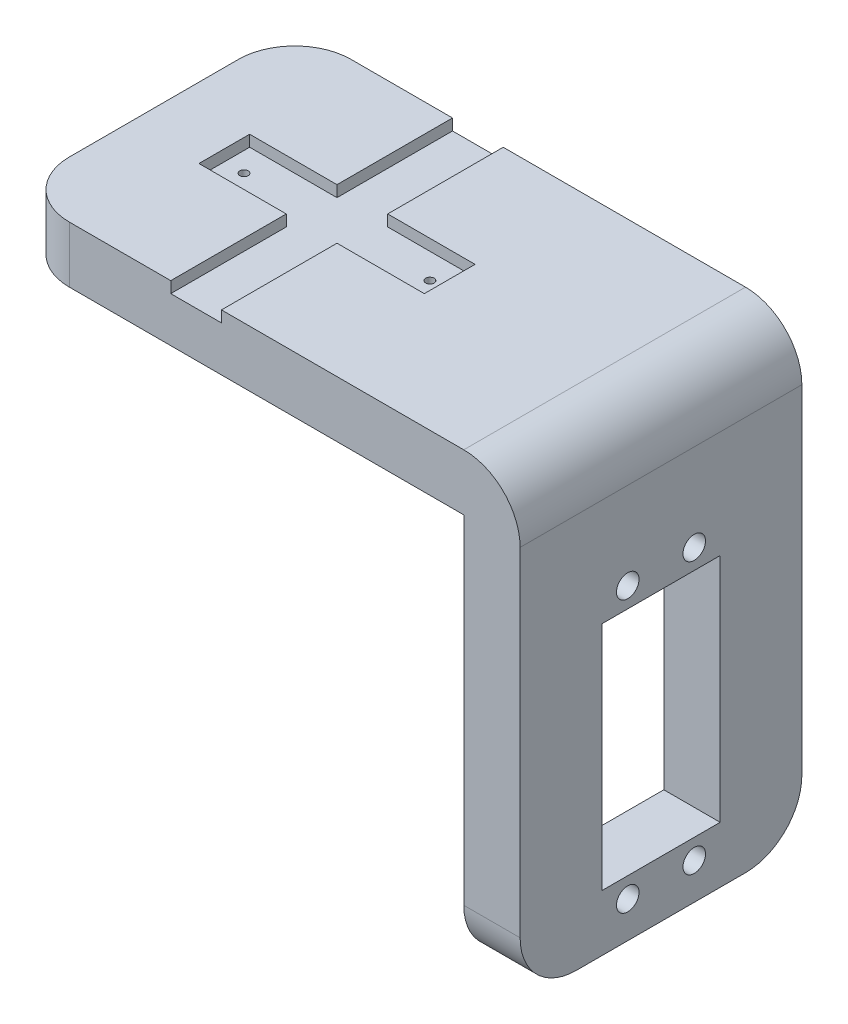
ISO-10303-21;
HEADER;
FILE_DESCRIPTION(('STEP AP214'),'2;1');
FILE_NAME('part.step','',(''),(''),'','','');
FILE_SCHEMA(('AUTOMOTIVE_DESIGN { 1 0 10303 214 1 1 1 1 }'));
ENDSEC;
DATA;
#1=APPLICATION_CONTEXT('core data for automotive mechanical design processes');
#2=APPLICATION_PROTOCOL_DEFINITION('international standard','automotive_design',2000,#1);
#3=PRODUCT_CONTEXT('',#1,'mechanical');
#4=PRODUCT('Part','Part','',(#3));
#5=PRODUCT_RELATED_PRODUCT_CATEGORY('part','',(#4));
#6=PRODUCT_DEFINITION_FORMATION('','',#4);
#7=PRODUCT_DEFINITION_CONTEXT('part definition',#1,'design');
#8=PRODUCT_DEFINITION('design','',#6,#7);
#9=PRODUCT_DEFINITION_SHAPE('','',#8);
#10=(LENGTH_UNIT() NAMED_UNIT(*) SI_UNIT(.MILLI.,.METRE.));
#11=(NAMED_UNIT(*) PLANE_ANGLE_UNIT() SI_UNIT($,.RADIAN.));
#12=(NAMED_UNIT(*) SI_UNIT($,.STERADIAN.) SOLID_ANGLE_UNIT());
#13=UNCERTAINTY_MEASURE_WITH_UNIT(LENGTH_MEASURE(1.E-05),#10,'distance_accuracy_value','');
#14=(GEOMETRIC_REPRESENTATION_CONTEXT(3) GLOBAL_UNCERTAINTY_ASSIGNED_CONTEXT((#13)) GLOBAL_UNIT_ASSIGNED_CONTEXT((#10,
#11,#12)) REPRESENTATION_CONTEXT('',''));
#15=CARTESIAN_POINT('',(0.,0.,0.));
#16=DIRECTION('',(0.,0.,1.));
#17=DIRECTION('',(1.,0.,0.));
#18=AXIS2_PLACEMENT_3D('',#15,#16,#17);
#19=CARTESIAN_POINT('',(38.5515908381555,-70.,-6.57807000019985));
#20=DIRECTION('',(-1.,0.,0.));
#21=DIRECTION('',(0.,0.,1.));
#22=AXIS2_PLACEMENT_3D('',#19,#20,#21);
#23=PLANE('',#22);
#24=CARTESIAN_POINT('',(38.5515908381555,-15.44,24.3219299998002));
#25=DIRECTION('',(-1.,0.,0.));
#26=DIRECTION('',(0.,0.,-1.));
#27=AXIS2_PLACEMENT_3D('',#24,#25,#26);
#28=CIRCLE('',#27,2.);
#29=CARTESIAN_POINT('',(38.5515908381555,-15.44,22.3219299998002));
#30=VERTEX_POINT('',#29);
#31=EDGE_CURVE('E450',#30,#30,#28,.T.);
#32=ORIENTED_EDGE('',*,*,#31,.F.);
#33=EDGE_LOOP('',(#32));
#34=FACE_BOUND('',#33,.T.);
#35=CARTESIAN_POINT('',(38.5515908381555,-15.44,12.5219299998001));
#36=DIRECTION('',(1.,0.,0.));
#37=DIRECTION('',(0.,0.,1.));
#38=AXIS2_PLACEMENT_3D('',#35,#36,#37);
#39=CIRCLE('',#38,2.);
#40=CARTESIAN_POINT('',(38.5515908381555,-15.44,14.5219299998001));
#41=VERTEX_POINT('',#40);
#42=EDGE_CURVE('E441',#41,#41,#39,.T.);
#43=ORIENTED_EDGE('',*,*,#42,.T.);
#44=EDGE_LOOP('',(#43));
#45=FACE_BOUND('',#44,.T.);
#46=CARTESIAN_POINT('',(38.5515908381555,-63.56,24.3219299998002));
#47=DIRECTION('',(1.,0.,0.));
#48=DIRECTION('',(0.,0.,-1.));
#49=AXIS2_PLACEMENT_3D('',#46,#47,#48);
#50=CIRCLE('',#49,2.);
#51=CARTESIAN_POINT('',(38.5515908381555,-63.56,22.3219299998002));
#52=VERTEX_POINT('',#51);
#53=EDGE_CURVE('E438',#52,#52,#50,.T.);
#54=ORIENTED_EDGE('',*,*,#53,.T.);
#55=EDGE_LOOP('',(#54));
#56=FACE_BOUND('',#55,.T.);
#57=CARTESIAN_POINT('',(38.5515908381555,-63.56,12.5219299998002));
#58=DIRECTION('',(-1.,0.,0.));
#59=DIRECTION('',(0.,0.,1.));
#60=AXIS2_PLACEMENT_3D('',#57,#58,#59);
#61=CIRCLE('',#60,2.);
#62=CARTESIAN_POINT('',(38.5515908381555,-63.56,14.5219299998002));
#63=VERTEX_POINT('',#62);
#64=EDGE_CURVE('E239',#63,#63,#61,.T.);
#65=ORIENTED_EDGE('',*,*,#64,.F.);
#66=EDGE_LOOP('',(#65));
#67=FACE_BOUND('',#66,.T.);
#68=DIRECTION('',(0.,1.,0.));
#69=VECTOR('',#68,1.);
#70=CARTESIAN_POINT('',(38.5515908381555,-70.,-6.57807000019985));
#71=LINE('',#70,#69);
#72=CARTESIAN_POINT('',(38.5515908381555,-60.,-6.57807000019985));
#73=VERTEX_POINT('',#72);
#74=CARTESIAN_POINT('',(38.5515908381555,0.,-6.57807000019985));
#75=VERTEX_POINT('',#74);
#76=EDGE_CURVE('E255',#73,#75,#71,.T.);
#77=ORIENTED_EDGE('',*,*,#76,.F.);
#78=CARTESIAN_POINT('',(38.5515908381555,-60.,3.42192999980015));
#79=DIRECTION('',(-1.,0.,0.));
#80=DIRECTION('',(0.,0.,1.));
#81=AXIS2_PLACEMENT_3D('',#78,#79,#80);
#82=CIRCLE('',#81,10.);
#83=CARTESIAN_POINT('',(38.5515908381555,-70.,3.42192999980015));
#84=VERTEX_POINT('',#83);
#85=EDGE_CURVE('E58',#73,#84,#82,.T.);
#86=ORIENTED_EDGE('',*,*,#85,.T.);
#87=DIRECTION('',(0.,0.,1.));
#88=VECTOR('',#87,1.);
#89=CARTESIAN_POINT('',(38.5515908381555,-70.,-6.57807000019985));
#90=LINE('',#89,#88);
#91=CARTESIAN_POINT('',(38.5515908381555,-70.,33.4219299998002));
#92=VERTEX_POINT('',#91);
#93=EDGE_CURVE('E248',#84,#92,#90,.T.);
#94=ORIENTED_EDGE('',*,*,#93,.T.);
#95=CARTESIAN_POINT('',(38.5515908381555,-60.,33.4219299998001));
#96=DIRECTION('',(-1.,0.,0.));
#97=DIRECTION('',(0.,0.,1.));
#98=AXIS2_PLACEMENT_3D('',#95,#96,#97);
#99=CIRCLE('',#98,10.);
#100=CARTESIAN_POINT('',(38.5515908381555,-60.,43.4219299998001));
#101=VERTEX_POINT('',#100);
#102=EDGE_CURVE('E420',#92,#101,#99,.T.);
#103=ORIENTED_EDGE('',*,*,#102,.T.);
#104=DIRECTION('',(0.,1.,0.));
#105=VECTOR('',#104,1.);
#106=CARTESIAN_POINT('',(38.5515908381555,-70.,43.4219299998001));
#107=LINE('',#106,#105);
#108=CARTESIAN_POINT('',(38.5515908381555,0.,43.4219299998001));
#109=VERTEX_POINT('',#108);
#110=EDGE_CURVE('E254',#101,#109,#107,.T.);
#111=ORIENTED_EDGE('',*,*,#110,.T.);
#112=DIRECTION('',(0.,0.,-1.));
#113=VECTOR('',#112,1.);
#114=CARTESIAN_POINT('',(38.5515908381555,0.,-6.57807000019985));
#115=LINE('',#114,#113);
#116=EDGE_CURVE('E375',#109,#75,#115,.T.);
#117=ORIENTED_EDGE('',*,*,#116,.T.);
#118=EDGE_LOOP('',(#77,#86,#94,#103,#111,#117));
#119=FACE_BOUND('',#118,.T.);
#120=DIRECTION('',(0.,0.,-1.));
#121=VECTOR('',#120,1.);
#122=CARTESIAN_POINT('',(38.5515908381555,-19.,18.4219299998002));
#123=LINE('',#122,#121);
#124=CARTESIAN_POINT('',(38.5515908381555,-19.,28.9219299998002));
#125=VERTEX_POINT('',#124);
#126=CARTESIAN_POINT('',(38.5515908381555,-19.,7.92192999980015));
#127=VERTEX_POINT('',#126);
#128=EDGE_CURVE('E234',#125,#127,#123,.T.);
#129=ORIENTED_EDGE('',*,*,#128,.F.);
#130=DIRECTION('',(0.,-1.,0.));
#131=VECTOR('',#130,1.);
#132=CARTESIAN_POINT('',(38.5515908381555,-60.,28.9219299998001));
#133=LINE('',#132,#131);
#134=CARTESIAN_POINT('',(38.5515908381555,-60.,28.9219299998001));
#135=VERTEX_POINT('',#134);
#136=EDGE_CURVE('E231',#125,#135,#133,.T.);
#137=ORIENTED_EDGE('',*,*,#136,.T.);
#138=DIRECTION('',(0.,0.,1.));
#139=VECTOR('',#138,1.);
#140=CARTESIAN_POINT('',(38.5515908381555,-60.,18.4219299998001));
#141=LINE('',#140,#139);
#142=CARTESIAN_POINT('',(38.5515908381555,-60.,7.92192999980015));
#143=VERTEX_POINT('',#142);
#144=EDGE_CURVE('E214',#143,#135,#141,.T.);
#145=ORIENTED_EDGE('',*,*,#144,.F.);
#146=DIRECTION('',(0.,-1.,0.));
#147=VECTOR('',#146,1.);
#148=CARTESIAN_POINT('',(38.5515908381555,-60.,7.92192999980015));
#149=LINE('',#148,#147);
#150=EDGE_CURVE('E224',#127,#143,#149,.T.);
#151=ORIENTED_EDGE('',*,*,#150,.F.);
#152=EDGE_LOOP('',(#129,#137,#145,#151));
#153=FACE_BOUND('',#152,.T.);
#154=ADVANCED_FACE('F33',(#34,#45,#56,#67,#119,#153),#23,.T.);
#155=CARTESIAN_POINT('',(48.5515908381555,-70.,-6.57807000019985));
#156=DIRECTION('',(1.,0.,0.));
#157=DIRECTION('',(0.,0.,-1.));
#158=AXIS2_PLACEMENT_3D('',#155,#156,#157);
#159=PLANE('',#158);
#160=CARTESIAN_POINT('',(48.5515908381555,-15.44,24.3219299998002));
#161=DIRECTION('',(1.,0.,0.));
#162=DIRECTION('',(0.,0.,-1.));
#163=AXIS2_PLACEMENT_3D('',#160,#161,#162);
#164=CIRCLE('',#163,2.);
#165=CARTESIAN_POINT('',(48.5515908381555,-15.44,22.3219299998002));
#166=VERTEX_POINT('',#165);
#167=EDGE_CURVE('E37',#166,#166,#164,.T.);
#168=ORIENTED_EDGE('',*,*,#167,.F.);
#169=EDGE_LOOP('',(#168));
#170=FACE_BOUND('',#169,.T.);
#171=CARTESIAN_POINT('',(48.5515908381555,-15.44,12.5219299998001));
#172=DIRECTION('',(1.,0.,0.));
#173=DIRECTION('',(0.,0.,-1.));
#174=AXIS2_PLACEMENT_3D('',#171,#172,#173);
#175=CIRCLE('',#174,2.);
#176=CARTESIAN_POINT('',(48.5515908381555,-15.44,10.5219299998001));
#177=VERTEX_POINT('',#176);
#178=EDGE_CURVE('E439',#177,#177,#175,.F.);
#179=ORIENTED_EDGE('',*,*,#178,.T.);
#180=EDGE_LOOP('',(#179));
#181=FACE_BOUND('',#180,.T.);
#182=CARTESIAN_POINT('',(48.5515908381555,-63.56,24.3219299998002));
#183=DIRECTION('',(1.,0.,0.));
#184=DIRECTION('',(0.,0.,-1.));
#185=AXIS2_PLACEMENT_3D('',#182,#183,#184);
#186=CIRCLE('',#185,2.);
#187=CARTESIAN_POINT('',(48.5515908381555,-63.56,22.3219299998002));
#188=VERTEX_POINT('',#187);
#189=EDGE_CURVE('E436',#188,#188,#186,.F.);
#190=ORIENTED_EDGE('',*,*,#189,.T.);
#191=EDGE_LOOP('',(#190));
#192=FACE_BOUND('',#191,.T.);
#193=CARTESIAN_POINT('',(48.5515908381555,-63.56,12.5219299998001));
#194=DIRECTION('',(1.,0.,0.));
#195=DIRECTION('',(0.,0.,-1.));
#196=AXIS2_PLACEMENT_3D('',#193,#194,#195);
#197=CIRCLE('',#196,2.);
#198=CARTESIAN_POINT('',(48.5515908381555,-63.56,10.5219299998001));
#199=VERTEX_POINT('',#198);
#200=EDGE_CURVE('E236',#199,#199,#197,.T.);
#201=ORIENTED_EDGE('',*,*,#200,.F.);
#202=EDGE_LOOP('',(#201));
#203=FACE_BOUND('',#202,.T.);
#204=DIRECTION('',(0.,0.,-1.));
#205=VECTOR('',#204,1.);
#206=CARTESIAN_POINT('',(48.5515908381555,-70.,-6.57807000019985));
#207=LINE('',#206,#205);
#208=CARTESIAN_POINT('',(48.5515908381555,-70.,33.4219299998002));
#209=VERTEX_POINT('',#208);
#210=CARTESIAN_POINT('',(48.5515908381555,-70.,3.42192999980015));
#211=VERTEX_POINT('',#210);
#212=EDGE_CURVE('E251',#209,#211,#207,.T.);
#213=ORIENTED_EDGE('',*,*,#212,.T.);
#214=CARTESIAN_POINT('',(48.5515908381555,-60.,3.42192999980015));
#215=DIRECTION('',(1.,0.,0.));
#216=DIRECTION('',(0.,0.,-1.));
#217=AXIS2_PLACEMENT_3D('',#214,#215,#216);
#218=CIRCLE('',#217,10.);
#219=CARTESIAN_POINT('',(48.5515908381555,-60.,-6.57807000019985));
#220=VERTEX_POINT('',#219);
#221=EDGE_CURVE('E428',#211,#220,#218,.T.);
#222=ORIENTED_EDGE('',*,*,#221,.T.);
#223=DIRECTION('',(0.,1.,0.));
#224=VECTOR('',#223,1.);
#225=CARTESIAN_POINT('',(48.5515908381555,-70.,-6.57807000019985));
#226=LINE('',#225,#224);
#227=CARTESIAN_POINT('',(48.5515908381555,0.,-6.57807000019985));
#228=VERTEX_POINT('',#227);
#229=EDGE_CURVE('E258',#220,#228,#226,.T.);
#230=ORIENTED_EDGE('',*,*,#229,.T.);
#231=DIRECTION('',(0.,0.,1.));
#232=VECTOR('',#231,1.);
#233=CARTESIAN_POINT('',(48.5515908381555,0.,-6.57807000019985));
#234=LINE('',#233,#232);
#235=CARTESIAN_POINT('',(48.5515908381555,0.,43.4219299998001));
#236=VERTEX_POINT('',#235);
#237=EDGE_CURVE('E372',#228,#236,#234,.T.);
#238=ORIENTED_EDGE('',*,*,#237,.T.);
#239=DIRECTION('',(0.,1.,0.));
#240=VECTOR('',#239,1.);
#241=CARTESIAN_POINT('',(48.5515908381555,-70.,43.4219299998001));
#242=LINE('',#241,#240);
#243=CARTESIAN_POINT('',(48.5515908381555,-60.,43.4219299998001));
#244=VERTEX_POINT('',#243);
#245=EDGE_CURVE('E260',#244,#236,#242,.T.);
#246=ORIENTED_EDGE('',*,*,#245,.F.);
#247=CARTESIAN_POINT('',(48.5515908381555,-60.,33.4219299998001));
#248=DIRECTION('',(1.,0.,0.));
#249=DIRECTION('',(0.,0.,-1.));
#250=AXIS2_PLACEMENT_3D('',#247,#248,#249);
#251=CIRCLE('',#250,10.);
#252=EDGE_CURVE('E418',#244,#209,#251,.T.);
#253=ORIENTED_EDGE('',*,*,#252,.T.);
#254=EDGE_LOOP('',(#213,#222,#230,#238,#246,#253));
#255=FACE_BOUND('',#254,.T.);
#256=DIRECTION('',(0.,1.,0.));
#257=VECTOR('',#256,1.);
#258=CARTESIAN_POINT('',(48.5515908381555,-70.,28.9219299998001));
#259=LINE('',#258,#257);
#260=CARTESIAN_POINT('',(48.5515908381555,-60.,28.9219299998001));
#261=VERTEX_POINT('',#260);
#262=CARTESIAN_POINT('',(48.5515908381555,-19.,28.9219299998001));
#263=VERTEX_POINT('',#262);
#264=EDGE_CURVE('E11',#261,#263,#259,.T.);
#265=ORIENTED_EDGE('',*,*,#264,.T.);
#266=DIRECTION('',(0.,0.,1.));
#267=VECTOR('',#266,1.);
#268=CARTESIAN_POINT('',(48.5515908381555,-19.,-6.57807000019987));
#269=LINE('',#268,#267);
#270=CARTESIAN_POINT('',(48.5515908381555,-19.,7.92192999980015));
#271=VERTEX_POINT('',#270);
#272=EDGE_CURVE('E431',#271,#263,#269,.T.);
#273=ORIENTED_EDGE('',*,*,#272,.F.);
#274=DIRECTION('',(0.,1.,0.));
#275=VECTOR('',#274,1.);
#276=CARTESIAN_POINT('',(48.5515908381555,-70.,7.92192999980015));
#277=LINE('',#276,#275);
#278=CARTESIAN_POINT('',(48.5515908381555,-60.,7.92192999980015));
#279=VERTEX_POINT('',#278);
#280=EDGE_CURVE('E433',#279,#271,#277,.T.);
#281=ORIENTED_EDGE('',*,*,#280,.F.);
#282=DIRECTION('',(0.,0.,-1.));
#283=VECTOR('',#282,1.);
#284=CARTESIAN_POINT('',(48.5515908381555,-60.,-6.57807000019985));
#285=LINE('',#284,#283);
#286=EDGE_CURVE('E42',#261,#279,#285,.T.);
#287=ORIENTED_EDGE('',*,*,#286,.F.);
#288=EDGE_LOOP('',(#265,#273,#281,#287));
#289=FACE_BOUND('',#288,.T.);
#290=ADVANCED_FACE('F458',(#170,#181,#192,#203,#255,#289),#159,.T.);
#291=CARTESIAN_POINT('',(-21.4484091618445,-60.,3.42192999980015));
#292=DIRECTION('',(-1.,0.,0.));
#293=DIRECTION('',(0.,0.,1.));
#294=AXIS2_PLACEMENT_3D('',#291,#292,#293);
#295=CYLINDRICAL_SURFACE('',#294,10.);
#296=DIRECTION('',(-1.,0.,0.));
#297=VECTOR('',#296,1.);
#298=CARTESIAN_POINT('',(-21.4484091618445,-60.,-6.57807000019985));
#299=LINE('',#298,#297);
#300=EDGE_CURVE('E422',#220,#73,#299,.T.);
#301=ORIENTED_EDGE('',*,*,#300,.F.);
#302=ORIENTED_EDGE('',*,*,#221,.F.);
#303=DIRECTION('',(-1.,0.,0.));
#304=VECTOR('',#303,1.);
#305=CARTESIAN_POINT('',(0.,-70.,3.42192999980015));
#306=LINE('',#305,#304);
#307=EDGE_CURVE('E425',#84,#211,#306,.F.);
#308=ORIENTED_EDGE('',*,*,#307,.F.);
#309=ORIENTED_EDGE('',*,*,#85,.F.);
#310=EDGE_LOOP('',(#301,#302,#308,#309));
#311=FACE_BOUND('',#310,.T.);
#312=ADVANCED_FACE('F35',(#311),#295,.T.);
#313=CARTESIAN_POINT('',(0.,-60.,33.4219299998001));
#314=DIRECTION('',(-1.,0.,0.));
#315=DIRECTION('',(0.,0.,1.));
#316=AXIS2_PLACEMENT_3D('',#313,#314,#315);
#317=CYLINDRICAL_SURFACE('',#316,10.);
#318=DIRECTION('',(-1.,0.,0.));
#319=VECTOR('',#318,1.);
#320=CARTESIAN_POINT('',(0.,-70.,33.4219299998001));
#321=LINE('',#320,#319);
#322=EDGE_CURVE('E412',#209,#92,#321,.T.);
#323=ORIENTED_EDGE('',*,*,#322,.F.);
#324=ORIENTED_EDGE('',*,*,#252,.F.);
#325=DIRECTION('',(-1.,0.,0.));
#326=VECTOR('',#325,1.);
#327=CARTESIAN_POINT('',(-21.4484091618445,-60.,43.4219299998001));
#328=LINE('',#327,#326);
#329=EDGE_CURVE('E415',#101,#244,#328,.F.);
#330=ORIENTED_EDGE('',*,*,#329,.F.);
#331=ORIENTED_EDGE('',*,*,#102,.F.);
#332=EDGE_LOOP('',(#323,#324,#330,#331));
#333=FACE_BOUND('',#332,.T.);
#334=ADVANCED_FACE('F544',(#333),#317,.T.);
#335=CARTESIAN_POINT('',(-31.4484091618445,10.,33.4219299998001));
#336=DIRECTION('',(0.,-1.,0.));
#337=DIRECTION('',(0.,0.,-1.));
#338=AXIS2_PLACEMENT_3D('',#335,#336,#337);
#339=CYLINDRICAL_SURFACE('',#338,10.);
#340=DIRECTION('',(0.,-1.,0.));
#341=VECTOR('',#340,1.);
#342=CARTESIAN_POINT('',(-31.4484091618445,10.,43.4219299998001));
#343=LINE('',#342,#341);
#344=CARTESIAN_POINT('',(-31.4484091618445,10.,43.4219299998001));
#345=VERTEX_POINT('',#344);
#346=CARTESIAN_POINT('',(-31.4484091618445,0.,43.4219299998001));
#347=VERTEX_POINT('',#346);
#348=EDGE_CURVE('E402',#345,#347,#343,.T.);
#349=ORIENTED_EDGE('',*,*,#348,.F.);
#350=CARTESIAN_POINT('',(-31.4484091618445,10.,33.4219299998001));
#351=DIRECTION('',(0.,1.,0.));
#352=DIRECTION('',(0.,0.,1.));
#353=AXIS2_PLACEMENT_3D('',#350,#351,#352);
#354=CIRCLE('',#353,10.);
#355=CARTESIAN_POINT('',(-41.4484091618445,10.,33.4219299998002));
#356=VERTEX_POINT('',#355);
#357=EDGE_CURVE('E408',#356,#345,#354,.T.);
#358=ORIENTED_EDGE('',*,*,#357,.F.);
#359=DIRECTION('',(0.,-1.,0.));
#360=VECTOR('',#359,1.);
#361=CARTESIAN_POINT('',(-41.4484091618445,0.,33.4219299998001));
#362=LINE('',#361,#360);
#363=CARTESIAN_POINT('',(-41.4484091618445,0.,33.4219299998002));
#364=VERTEX_POINT('',#363);
#365=EDGE_CURVE('E405',#364,#356,#362,.F.);
#366=ORIENTED_EDGE('',*,*,#365,.F.);
#367=CARTESIAN_POINT('',(-31.4484091618445,0.,33.4219299998001));
#368=DIRECTION('',(0.,1.,0.));
#369=DIRECTION('',(0.,0.,1.));
#370=AXIS2_PLACEMENT_3D('',#367,#368,#369);
#371=CIRCLE('',#370,10.);
#372=EDGE_CURVE('E410',#347,#364,#371,.F.);
#373=ORIENTED_EDGE('',*,*,#372,.F.);
#374=EDGE_LOOP('',(#349,#358,#366,#373));
#375=FACE_BOUND('',#374,.T.);
#376=ADVANCED_FACE('F549',(#375),#339,.T.);
#377=CARTESIAN_POINT('',(-31.4484091618445,10.,3.42192999980015));
#378=DIRECTION('',(0.,1.,0.));
#379=DIRECTION('',(0.,0.,1.));
#380=AXIS2_PLACEMENT_3D('',#377,#378,#379);
#381=CYLINDRICAL_SURFACE('',#380,10.);
#382=DIRECTION('',(0.,1.,0.));
#383=VECTOR('',#382,1.);
#384=CARTESIAN_POINT('',(-31.4484091618445,10.,-6.57807000019985));
#385=LINE('',#384,#383);
#386=CARTESIAN_POINT('',(-31.4484091618445,0.,-6.57807000019985));
#387=VERTEX_POINT('',#386);
#388=CARTESIAN_POINT('',(-31.4484091618445,10.,-6.57807000019985));
#389=VERTEX_POINT('',#388);
#390=EDGE_CURVE('E391',#387,#389,#385,.T.);
#391=ORIENTED_EDGE('',*,*,#390,.F.);
#392=CARTESIAN_POINT('',(-31.4484091618445,0.,3.42192999980015));
#393=DIRECTION('',(0.,1.,0.));
#394=DIRECTION('',(0.,0.,1.));
#395=AXIS2_PLACEMENT_3D('',#392,#393,#394);
#396=CIRCLE('',#395,10.);
#397=CARTESIAN_POINT('',(-41.4484091618445,0.,3.42192999980015));
#398=VERTEX_POINT('',#397);
#399=EDGE_CURVE('E397',#398,#387,#396,.F.);
#400=ORIENTED_EDGE('',*,*,#399,.F.);
#401=DIRECTION('',(0.,1.,0.));
#402=VECTOR('',#401,1.);
#403=CARTESIAN_POINT('',(-41.4484091618445,0.,3.42192999980015));
#404=LINE('',#403,#402);
#405=CARTESIAN_POINT('',(-41.4484091618445,10.,3.42192999980015));
#406=VERTEX_POINT('',#405);
#407=EDGE_CURVE('E394',#406,#398,#404,.F.);
#408=ORIENTED_EDGE('',*,*,#407,.F.);
#409=CARTESIAN_POINT('',(-31.4484091618445,10.,3.42192999980015));
#410=DIRECTION('',(0.,1.,0.));
#411=DIRECTION('',(0.,0.,1.));
#412=AXIS2_PLACEMENT_3D('',#409,#410,#411);
#413=CIRCLE('',#412,10.);
#414=EDGE_CURVE('E399',#389,#406,#413,.T.);
#415=ORIENTED_EDGE('',*,*,#414,.F.);
#416=EDGE_LOOP('',(#391,#400,#408,#415));
#417=FACE_BOUND('',#416,.T.);
#418=ADVANCED_FACE('F478',(#417),#381,.T.);
#419=CARTESIAN_POINT('',(38.5515908381555,0.,-6.57807000019985));
#420=DIRECTION('',(0.,0.,1.));
#421=DIRECTION('',(1.,0.,0.));
#422=AXIS2_PLACEMENT_3D('',#419,#420,#421);
#423=CYLINDRICAL_SURFACE('',#422,10.);
#424=ORIENTED_EDGE('',*,*,#237,.F.);
#425=CARTESIAN_POINT('',(38.5515908381555,0.,-6.57807000019985));
#426=DIRECTION('',(0.,0.,1.));
#427=DIRECTION('',(1.,0.,0.));
#428=AXIS2_PLACEMENT_3D('',#425,#426,#427);
#429=CIRCLE('',#428,10.);
#430=CARTESIAN_POINT('',(38.5515908381555,10.,-6.57807000019985));
#431=VERTEX_POINT('',#430);
#432=EDGE_CURVE('E386',#431,#228,#429,.F.);
#433=ORIENTED_EDGE('',*,*,#432,.F.);
#434=DIRECTION('',(0.,0.,1.));
#435=VECTOR('',#434,1.);
#436=CARTESIAN_POINT('',(38.5515908381555,10.,0.));
#437=LINE('',#436,#435);
#438=CARTESIAN_POINT('',(38.5515908381555,10.,43.4219299998001));
#439=VERTEX_POINT('',#438);
#440=EDGE_CURVE('E383',#439,#431,#437,.F.);
#441=ORIENTED_EDGE('',*,*,#440,.F.);
#442=CARTESIAN_POINT('',(38.5515908381555,0.,43.4219299998002));
#443=DIRECTION('',(0.,0.,-1.));
#444=DIRECTION('',(-1.,0.,0.));
#445=AXIS2_PLACEMENT_3D('',#442,#443,#444);
#446=CIRCLE('',#445,10.);
#447=EDGE_CURVE('E389',#236,#439,#446,.F.);
#448=ORIENTED_EDGE('',*,*,#447,.F.);
#449=EDGE_LOOP('',(#424,#433,#441,#448));
#450=FACE_BOUND('',#449,.T.);
#451=ADVANCED_FACE('F531',(#450),#423,.T.);
#452=CARTESIAN_POINT('',(0.,10.,0.));
#453=DIRECTION('',(0.,1.,0.));
#454=DIRECTION('',(0.,0.,1.));
#455=AXIS2_PLACEMENT_3D('',#452,#453,#454);
#456=PLANE('',#455);
#457=DIRECTION('',(1.,0.,0.));
#458=VECTOR('',#457,1.);
#459=CARTESIAN_POINT('',(-21.4484091618445,10.,43.4219299998001));
#460=LINE('',#459,#458);
#461=CARTESIAN_POINT('',(-4.44840916184454,10.,43.4219299998002));
#462=VERTEX_POINT('',#461);
#463=EDGE_CURVE('E369',#462,#439,#460,.T.);
#464=ORIENTED_EDGE('',*,*,#463,.T.);
#465=ORIENTED_EDGE('',*,*,#440,.T.);
#466=DIRECTION('',(-1.,0.,0.));
#467=VECTOR('',#466,1.);
#468=CARTESIAN_POINT('',(-21.4484091618445,10.,-6.57807000019985));
#469=LINE('',#468,#467);
#470=CARTESIAN_POINT('',(-4.44840916184454,10.,-6.57807000019985));
#471=VERTEX_POINT('',#470);
#472=EDGE_CURVE('E370',#431,#471,#469,.T.);
#473=ORIENTED_EDGE('',*,*,#472,.T.);
#474=DIRECTION('',(0.,0.,-1.));
#475=VECTOR('',#474,1.);
#476=CARTESIAN_POINT('',(-4.44840916184453,10.,13.9219299998002));
#477=LINE('',#476,#475);
#478=CARTESIAN_POINT('',(-4.44840916184453,10.,13.9219299998002));
#479=VERTEX_POINT('',#478);
#480=EDGE_CURVE('E291',#479,#471,#477,.T.);
#481=ORIENTED_EDGE('',*,*,#480,.F.);
#482=DIRECTION('',(-1.,0.,0.));
#483=VECTOR('',#482,1.);
#484=CARTESIAN_POINT('',(-8.94840916184453,10.,13.9219299998002));
#485=LINE('',#484,#483);
#486=CARTESIAN_POINT('',(11.0515908381555,10.,13.9219299998002));
#487=VERTEX_POINT('',#486);
#488=EDGE_CURVE('E338',#487,#479,#485,.T.);
#489=ORIENTED_EDGE('',*,*,#488,.F.);
#490=DIRECTION('',(0.,0.,1.));
#491=VECTOR('',#490,1.);
#492=CARTESIAN_POINT('',(11.0515908381555,10.,22.9219299998002));
#493=LINE('',#492,#491);
#494=CARTESIAN_POINT('',(11.0515908381555,10.,22.9219299998002));
#495=VERTEX_POINT('',#494);
#496=EDGE_CURVE('E314',#487,#495,#493,.T.);
#497=ORIENTED_EDGE('',*,*,#496,.T.);
#498=DIRECTION('',(1.,0.,0.));
#499=VECTOR('',#498,1.);
#500=CARTESIAN_POINT('',(-8.94840916184453,10.,22.9219299998002));
#501=LINE('',#500,#499);
#502=CARTESIAN_POINT('',(-4.44840916184453,10.,22.9219299998002));
#503=VERTEX_POINT('',#502);
#504=EDGE_CURVE('E348',#503,#495,#501,.T.);
#505=ORIENTED_EDGE('',*,*,#504,.F.);
#506=DIRECTION('',(0.,0.,1.));
#507=VECTOR('',#506,1.);
#508=CARTESIAN_POINT('',(-4.44840916184453,10.,22.9219299998002));
#509=LINE('',#508,#507);
#510=EDGE_CURVE('E272',#503,#462,#509,.T.);
#511=ORIENTED_EDGE('',*,*,#510,.T.);
#512=EDGE_LOOP('',(#464,#465,#473,#481,#489,#497,#505,#511));
#513=FACE_BOUND('',#512,.T.);
#514=ADVANCED_FACE('F506',(#513),#456,.T.);
#515=DIRECTION('',(0.,0.,-1.));
#516=VECTOR('',#515,1.);
#517=CARTESIAN_POINT('',(-41.4484091618445,10.,-6.57807000019985));
#518=LINE('',#517,#516);
#519=EDGE_CURVE('E363',#356,#406,#518,.T.);
#520=ORIENTED_EDGE('',*,*,#519,.F.);
#521=ORIENTED_EDGE('',*,*,#357,.T.);
#522=CARTESIAN_POINT('',(-13.4484091618445,10.,43.4219299998002));
#523=VERTEX_POINT('',#522);
#524=EDGE_CURVE('E366',#345,#523,#460,.T.);
#525=ORIENTED_EDGE('',*,*,#524,.T.);
#526=DIRECTION('',(0.,0.,-1.));
#527=VECTOR('',#526,1.);
#528=CARTESIAN_POINT('',(-13.4484091618445,10.,22.9219299998001));
#529=LINE('',#528,#527);
#530=CARTESIAN_POINT('',(-13.4484091618445,10.,22.9219299998001));
#531=VERTEX_POINT('',#530);
#532=EDGE_CURVE('E279',#523,#531,#529,.T.);
#533=ORIENTED_EDGE('',*,*,#532,.T.);
#534=CARTESIAN_POINT('',(-28.9484091618445,10.,22.9219299998002));
#535=VERTEX_POINT('',#534);
#536=EDGE_CURVE('E349',#535,#531,#501,.T.);
#537=ORIENTED_EDGE('',*,*,#536,.F.);
#538=DIRECTION('',(0.,0.,1.));
#539=VECTOR('',#538,1.);
#540=CARTESIAN_POINT('',(-28.9484091618445,10.,22.9219299998002));
#541=LINE('',#540,#539);
#542=CARTESIAN_POINT('',(-28.9484091618445,10.,13.9219299998002));
#543=VERTEX_POINT('',#542);
#544=EDGE_CURVE('E331',#543,#535,#541,.T.);
#545=ORIENTED_EDGE('',*,*,#544,.F.);
#546=CARTESIAN_POINT('',(-13.4484091618445,10.,13.9219299998002));
#547=VERTEX_POINT('',#546);
#548=EDGE_CURVE('E352',#547,#543,#485,.T.);
#549=ORIENTED_EDGE('',*,*,#548,.F.);
#550=DIRECTION('',(0.,0.,1.));
#551=VECTOR('',#550,1.);
#552=CARTESIAN_POINT('',(-13.4484091618445,10.,13.9219299998002));
#553=LINE('',#552,#551);
#554=CARTESIAN_POINT('',(-13.4484091618445,10.,-6.57807000019985));
#555=VERTEX_POINT('',#554);
#556=EDGE_CURVE('E303',#555,#547,#553,.T.);
#557=ORIENTED_EDGE('',*,*,#556,.F.);
#558=EDGE_CURVE('E368',#555,#389,#469,.T.);
#559=ORIENTED_EDGE('',*,*,#558,.T.);
#560=ORIENTED_EDGE('',*,*,#414,.T.);
#561=EDGE_LOOP('',(#520,#521,#525,#533,#537,#545,#549,#557,#559,#560));
#562=FACE_BOUND('',#561,.T.);
#563=ADVANCED_FACE('F485',(#562),#456,.T.);
#564=CARTESIAN_POINT('',(-21.4484091618445,10.,43.4219299998001));
#565=DIRECTION('',(0.,0.,-1.));
#566=DIRECTION('',(-1.,0.,0.));
#567=AXIS2_PLACEMENT_3D('',#564,#565,#566);
#568=PLANE('',#567);
#569=ORIENTED_EDGE('',*,*,#110,.F.);
#570=ORIENTED_EDGE('',*,*,#329,.T.);
#571=ORIENTED_EDGE('',*,*,#245,.T.);
#572=ORIENTED_EDGE('',*,*,#447,.T.);
#573=ORIENTED_EDGE('',*,*,#463,.F.);
#574=DIRECTION('',(0.,1.,0.));
#575=VECTOR('',#574,1.);
#576=CARTESIAN_POINT('',(-4.44840916184454,8.,43.4219299998002));
#577=LINE('',#576,#575);
#578=CARTESIAN_POINT('',(-4.44840916184454,8.,43.4219299998002));
#579=VERTEX_POINT('',#578);
#580=EDGE_CURVE('E289',#579,#462,#577,.T.);
#581=ORIENTED_EDGE('',*,*,#580,.F.);
#582=DIRECTION('',(-1.,0.,0.));
#583=VECTOR('',#582,1.);
#584=CARTESIAN_POINT('',(-4.44840916184454,8.,43.4219299998002));
#585=LINE('',#584,#583);
#586=CARTESIAN_POINT('',(-13.4484091618445,8.,43.4219299998002));
#587=VERTEX_POINT('',#586);
#588=EDGE_CURVE('E281',#579,#587,#585,.T.);
#589=ORIENTED_EDGE('',*,*,#588,.T.);
#590=DIRECTION('',(0.,1.,0.));
#591=VECTOR('',#590,1.);
#592=CARTESIAN_POINT('',(-13.4484091618445,8.,43.4219299998002));
#593=LINE('',#592,#591);
#594=EDGE_CURVE('E292',#587,#523,#593,.T.);
#595=ORIENTED_EDGE('',*,*,#594,.T.);
#596=ORIENTED_EDGE('',*,*,#524,.F.);
#597=ORIENTED_EDGE('',*,*,#348,.T.);
#598=DIRECTION('',(1.,0.,0.));
#599=VECTOR('',#598,1.);
#600=CARTESIAN_POINT('',(-21.4484091618445,0.,43.4219299998001));
#601=LINE('',#600,#599);
#602=EDGE_CURVE('E365',#347,#109,#601,.T.);
#603=ORIENTED_EDGE('',*,*,#602,.T.);
#604=EDGE_LOOP('',(#569,#570,#571,#572,#573,#581,#589,#595,#596,#597,#603));
#605=FACE_BOUND('',#604,.T.);
#606=ADVANCED_FACE('F526',(#605),#568,.F.);
#607=CARTESIAN_POINT('',(-8.94840916184453,8.,22.9219299998002));
#608=DIRECTION('',(0.,0.,1.));
#609=DIRECTION('',(1.,0.,0.));
#610=AXIS2_PLACEMENT_3D('',#607,#608,#609);
#611=PLANE('',#610);
#612=DIRECTION('',(0.,1.,0.));
#613=VECTOR('',#612,1.);
#614=CARTESIAN_POINT('',(-4.44840916184453,8.,22.9219299998002));
#615=LINE('',#614,#613);
#616=CARTESIAN_POINT('',(-4.44840916184453,8.,22.9219299998002));
#617=VERTEX_POINT('',#616);
#618=EDGE_CURVE('E284',#617,#503,#615,.T.);
#619=ORIENTED_EDGE('',*,*,#618,.T.);
#620=ORIENTED_EDGE('',*,*,#504,.T.);
#621=DIRECTION('',(0.,1.,0.));
#622=VECTOR('',#621,1.);
#623=CARTESIAN_POINT('',(11.0515908381555,8.,22.9219299998002));
#624=LINE('',#623,#622);
#625=CARTESIAN_POINT('',(11.0515908381555,8.,22.9219299998002));
#626=VERTEX_POINT('',#625);
#627=EDGE_CURVE('E328',#626,#495,#624,.T.);
#628=ORIENTED_EDGE('',*,*,#627,.F.);
#629=DIRECTION('',(1.,0.,0.));
#630=VECTOR('',#629,1.);
#631=CARTESIAN_POINT('',(-8.94840916184453,8.,22.9219299998002));
#632=LINE('',#631,#630);
#633=EDGE_CURVE('E337',#617,#626,#632,.T.);
#634=ORIENTED_EDGE('',*,*,#633,.F.);
#635=EDGE_LOOP('',(#619,#620,#628,#634));
#636=FACE_BOUND('',#635,.T.);
#637=ADVANCED_FACE('F518',(#636),#611,.F.);
#638=DIRECTION('',(0.,1.,0.));
#639=VECTOR('',#638,1.);
#640=CARTESIAN_POINT('',(-13.4484091618445,8.,22.9219299998001));
#641=LINE('',#640,#639);
#642=CARTESIAN_POINT('',(-13.4484091618445,8.,22.9219299998001));
#643=VERTEX_POINT('',#642);
#644=EDGE_CURVE('E295',#643,#531,#641,.T.);
#645=ORIENTED_EDGE('',*,*,#644,.F.);
#646=CARTESIAN_POINT('',(-28.9484091618445,8.,22.9219299998002));
#647=VERTEX_POINT('',#646);
#648=EDGE_CURVE('E339',#647,#643,#632,.T.);
#649=ORIENTED_EDGE('',*,*,#648,.F.);
#650=DIRECTION('',(0.,1.,0.));
#651=VECTOR('',#650,1.);
#652=CARTESIAN_POINT('',(-28.9484091618445,8.,22.9219299998002));
#653=LINE('',#652,#651);
#654=EDGE_CURVE('E346',#647,#535,#653,.T.);
#655=ORIENTED_EDGE('',*,*,#654,.T.);
#656=ORIENTED_EDGE('',*,*,#536,.T.);
#657=EDGE_LOOP('',(#645,#649,#655,#656));
#658=FACE_BOUND('',#657,.T.);
#659=ADVANCED_FACE('F559',(#658),#611,.F.);
#660=CARTESIAN_POINT('',(-8.94840916184453,8.,13.9219299998002));
#661=DIRECTION('',(0.,0.,-1.));
#662=DIRECTION('',(-1.,0.,0.));
#663=AXIS2_PLACEMENT_3D('',#660,#661,#662);
#664=PLANE('',#663);
#665=ORIENTED_EDGE('',*,*,#488,.T.);
#666=DIRECTION('',(0.,1.,0.));
#667=VECTOR('',#666,1.);
#668=CARTESIAN_POINT('',(-4.44840916184453,8.,13.9219299998002));
#669=LINE('',#668,#667);
#670=CARTESIAN_POINT('',(-4.44840916184453,8.,13.9219299998002));
#671=VERTEX_POINT('',#670);
#672=EDGE_CURVE('E312',#671,#479,#669,.T.);
#673=ORIENTED_EDGE('',*,*,#672,.F.);
#674=DIRECTION('',(-1.,0.,0.));
#675=VECTOR('',#674,1.);
#676=CARTESIAN_POINT('',(-8.94840916184453,8.,13.9219299998002));
#677=LINE('',#676,#675);
#678=CARTESIAN_POINT('',(11.0515908381555,8.,13.9219299998002));
#679=VERTEX_POINT('',#678);
#680=EDGE_CURVE('E343',#679,#671,#677,.T.);
#681=ORIENTED_EDGE('',*,*,#680,.F.);
#682=DIRECTION('',(0.,1.,0.));
#683=VECTOR('',#682,1.);
#684=CARTESIAN_POINT('',(11.0515908381555,8.,13.9219299998002));
#685=LINE('',#684,#683);
#686=EDGE_CURVE('E325',#679,#487,#685,.T.);
#687=ORIENTED_EDGE('',*,*,#686,.T.);
#688=EDGE_LOOP('',(#665,#673,#681,#687));
#689=FACE_BOUND('',#688,.T.);
#690=ADVANCED_FACE('F508',(#689),#664,.F.);
#691=CARTESIAN_POINT('',(-21.4484091618445,10.,-6.57807000019985));
#692=DIRECTION('',(0.,0.,1.));
#693=DIRECTION('',(1.,0.,0.));
#694=AXIS2_PLACEMENT_3D('',#691,#692,#693);
#695=PLANE('',#694);
#696=ORIENTED_EDGE('',*,*,#229,.F.);
#697=ORIENTED_EDGE('',*,*,#300,.T.);
#698=ORIENTED_EDGE('',*,*,#76,.T.);
#699=DIRECTION('',(-1.,0.,0.));
#700=VECTOR('',#699,1.);
#701=CARTESIAN_POINT('',(-21.4484091618445,0.,-6.57807000019985));
#702=LINE('',#701,#700);
#703=EDGE_CURVE('E378',#75,#387,#702,.T.);
#704=ORIENTED_EDGE('',*,*,#703,.T.);
#705=ORIENTED_EDGE('',*,*,#390,.T.);
#706=ORIENTED_EDGE('',*,*,#558,.F.);
#707=DIRECTION('',(0.,1.,0.));
#708=VECTOR('',#707,1.);
#709=CARTESIAN_POINT('',(-13.4484091618445,8.,-6.57807000019985));
#710=LINE('',#709,#708);
#711=CARTESIAN_POINT('',(-13.4484091618445,8.,-6.57807000019985));
#712=VERTEX_POINT('',#711);
#713=EDGE_CURVE('E318',#712,#555,#710,.T.);
#714=ORIENTED_EDGE('',*,*,#713,.F.);
#715=DIRECTION('',(-1.,0.,0.));
#716=VECTOR('',#715,1.);
#717=CARTESIAN_POINT('',(-4.44840916184454,8.,-6.57807000019985));
#718=LINE('',#717,#716);
#719=CARTESIAN_POINT('',(-4.44840916184454,8.,-6.57807000019985));
#720=VERTEX_POINT('',#719);
#721=EDGE_CURVE('E302',#720,#712,#718,.T.);
#722=ORIENTED_EDGE('',*,*,#721,.F.);
#723=DIRECTION('',(0.,1.,0.));
#724=VECTOR('',#723,1.);
#725=CARTESIAN_POINT('',(-4.44840916184454,8.,-6.57807000019985));
#726=LINE('',#725,#724);
#727=EDGE_CURVE('E308',#720,#471,#726,.T.);
#728=ORIENTED_EDGE('',*,*,#727,.T.);
#729=ORIENTED_EDGE('',*,*,#472,.F.);
#730=ORIENTED_EDGE('',*,*,#432,.T.);
#731=EDGE_LOOP('',(#696,#697,#698,#704,#705,#706,#714,#722,#728,#729,#730));
#732=FACE_BOUND('',#731,.T.);
#733=ADVANCED_FACE('F469',(#732),#695,.F.);
#734=CARTESIAN_POINT('',(0.,0.,0.));
#735=DIRECTION('',(0.,1.,0.));
#736=DIRECTION('',(0.,0.,1.));
#737=AXIS2_PLACEMENT_3D('',#734,#735,#736);
#738=PLANE('',#737);
#739=CARTESIAN_POINT('',(7.55159083815546,0.,18.4219299998001));
#740=DIRECTION('',(0.,-1.,0.));
#741=DIRECTION('',(0.,0.,1.));
#742=AXIS2_PLACEMENT_3D('',#739,#740,#741);
#743=CIRCLE('',#742,0.750000000000002);
#744=CARTESIAN_POINT('',(7.55159083815546,0.,19.1719299998001));
#745=VERTEX_POINT('',#744);
#746=EDGE_CURVE('E263',#745,#745,#743,.T.);
#747=ORIENTED_EDGE('',*,*,#746,.F.);
#748=EDGE_LOOP('',(#747));
#749=FACE_BOUND('',#748,.T.);
#750=CARTESIAN_POINT('',(-25.4484091618445,0.,18.4219299998001));
#751=DIRECTION('',(0.,1.,0.));
#752=DIRECTION('',(0.,0.,1.));
#753=AXIS2_PLACEMENT_3D('',#750,#751,#752);
#754=CIRCLE('',#753,0.750000000000002);
#755=CARTESIAN_POINT('',(-25.4484091618445,0.,19.1719299998001));
#756=VERTEX_POINT('',#755);
#757=EDGE_CURVE('E269',#756,#756,#754,.T.);
#758=ORIENTED_EDGE('',*,*,#757,.T.);
#759=EDGE_LOOP('',(#758));
#760=FACE_BOUND('',#759,.T.);
#761=ORIENTED_EDGE('',*,*,#602,.F.);
#762=ORIENTED_EDGE('',*,*,#372,.T.);
#763=DIRECTION('',(0.,0.,1.));
#764=VECTOR('',#763,1.);
#765=CARTESIAN_POINT('',(-41.4484091618445,0.,-6.57807000019985));
#766=LINE('',#765,#764);
#767=EDGE_CURVE('E358',#398,#364,#766,.T.);
#768=ORIENTED_EDGE('',*,*,#767,.F.);
#769=ORIENTED_EDGE('',*,*,#399,.T.);
#770=ORIENTED_EDGE('',*,*,#703,.F.);
#771=ORIENTED_EDGE('',*,*,#116,.F.);
#772=EDGE_LOOP('',(#761,#762,#768,#769,#770,#771));
#773=FACE_BOUND('',#772,.T.);
#774=ADVANCED_FACE('F473',(#749,#760,#773),#738,.F.);
#775=CARTESIAN_POINT('',(-41.4484091618445,0.,0.));
#776=DIRECTION('',(1.,0.,0.));
#777=DIRECTION('',(0.,0.,-1.));
#778=AXIS2_PLACEMENT_3D('',#775,#776,#777);
#779=PLANE('',#778);
#780=ORIENTED_EDGE('',*,*,#767,.T.);
#781=ORIENTED_EDGE('',*,*,#365,.T.);
#782=ORIENTED_EDGE('',*,*,#519,.T.);
#783=ORIENTED_EDGE('',*,*,#407,.T.);
#784=EDGE_LOOP('',(#780,#781,#782,#783));
#785=FACE_BOUND('',#784,.T.);
#786=ADVANCED_FACE('F551',(#785),#779,.F.);
#787=CARTESIAN_POINT('',(-28.9484091618445,8.,22.9219299998002));
#788=DIRECTION('',(-1.,0.,0.));
#789=DIRECTION('',(0.,0.,1.));
#790=AXIS2_PLACEMENT_3D('',#787,#788,#789);
#791=PLANE('',#790);
#792=ORIENTED_EDGE('',*,*,#544,.T.);
#793=ORIENTED_EDGE('',*,*,#654,.F.);
#794=DIRECTION('',(0.,0.,1.));
#795=VECTOR('',#794,1.);
#796=CARTESIAN_POINT('',(-28.9484091618445,8.,22.9219299998002));
#797=LINE('',#796,#795);
#798=CARTESIAN_POINT('',(-28.9484091618445,8.,13.9219299998002));
#799=VERTEX_POINT('',#798);
#800=EDGE_CURVE('E334',#799,#647,#797,.T.);
#801=ORIENTED_EDGE('',*,*,#800,.F.);
#802=DIRECTION('',(0.,1.,0.));
#803=VECTOR('',#802,1.);
#804=CARTESIAN_POINT('',(-28.9484091618445,8.,13.9219299998002));
#805=LINE('',#804,#803);
#806=EDGE_CURVE('E355',#799,#543,#805,.T.);
#807=ORIENTED_EDGE('',*,*,#806,.T.);
#808=EDGE_LOOP('',(#792,#793,#801,#807));
#809=FACE_BOUND('',#808,.T.);
#810=ADVANCED_FACE('F562',(#809),#791,.F.);
#811=CARTESIAN_POINT('',(-13.4484091618445,8.,13.9219299998002));
#812=VERTEX_POINT('',#811);
#813=EDGE_CURVE('E342',#812,#799,#677,.T.);
#814=ORIENTED_EDGE('',*,*,#813,.F.);
#815=DIRECTION('',(0.,1.,0.));
#816=VECTOR('',#815,1.);
#817=CARTESIAN_POINT('',(-13.4484091618445,8.,13.9219299998002));
#818=LINE('',#817,#816);
#819=EDGE_CURVE('E315',#812,#547,#818,.T.);
#820=ORIENTED_EDGE('',*,*,#819,.T.);
#821=ORIENTED_EDGE('',*,*,#548,.T.);
#822=ORIENTED_EDGE('',*,*,#806,.F.);
#823=EDGE_LOOP('',(#814,#820,#821,#822));
#824=FACE_BOUND('',#823,.T.);
#825=ADVANCED_FACE('F493',(#824),#664,.F.);
#826=CARTESIAN_POINT('',(0.,8.,0.));
#827=DIRECTION('',(0.,1.,0.));
#828=DIRECTION('',(0.,0.,1.));
#829=AXIS2_PLACEMENT_3D('',#826,#827,#828);
#830=PLANE('',#829);
#831=CARTESIAN_POINT('',(7.55159083815546,8.,18.4219299998001));
#832=DIRECTION('',(0.,-1.,0.));
#833=DIRECTION('',(0.,0.,1.));
#834=AXIS2_PLACEMENT_3D('',#831,#832,#833);
#835=CIRCLE('',#834,0.750000000000002);
#836=CARTESIAN_POINT('',(7.55159083815546,8.,19.1719299998001));
#837=VERTEX_POINT('',#836);
#838=EDGE_CURVE('E257',#837,#837,#835,.T.);
#839=ORIENTED_EDGE('',*,*,#838,.T.);
#840=EDGE_LOOP('',(#839));
#841=FACE_BOUND('',#840,.T.);
#842=CARTESIAN_POINT('',(-25.4484091618445,8.,18.4219299998001));
#843=DIRECTION('',(0.,1.,0.));
#844=DIRECTION('',(0.,0.,1.));
#845=AXIS2_PLACEMENT_3D('',#842,#843,#844);
#846=CIRCLE('',#845,0.750000000000002);
#847=CARTESIAN_POINT('',(-25.4484091618445,8.,19.1719299998001));
#848=VERTEX_POINT('',#847);
#849=EDGE_CURVE('E266',#848,#848,#846,.T.);
#850=ORIENTED_EDGE('',*,*,#849,.F.);
#851=EDGE_LOOP('',(#850));
#852=FACE_BOUND('',#851,.T.);
#853=ORIENTED_EDGE('',*,*,#800,.T.);
#854=ORIENTED_EDGE('',*,*,#648,.T.);
#855=DIRECTION('',(0.,0.,-1.));
#856=VECTOR('',#855,1.);
#857=CARTESIAN_POINT('',(-13.4484091618445,8.,22.9219299998001));
#858=LINE('',#857,#856);
#859=EDGE_CURVE('E278',#587,#643,#858,.T.);
#860=ORIENTED_EDGE('',*,*,#859,.F.);
#861=ORIENTED_EDGE('',*,*,#588,.F.);
#862=DIRECTION('',(0.,0.,1.));
#863=VECTOR('',#862,1.);
#864=CARTESIAN_POINT('',(-4.44840916184453,8.,22.9219299998002));
#865=LINE('',#864,#863);
#866=EDGE_CURVE('E275',#617,#579,#865,.T.);
#867=ORIENTED_EDGE('',*,*,#866,.F.);
#868=ORIENTED_EDGE('',*,*,#633,.T.);
#869=DIRECTION('',(0.,0.,1.));
#870=VECTOR('',#869,1.);
#871=CARTESIAN_POINT('',(11.0515908381555,8.,22.9219299998002));
#872=LINE('',#871,#870);
#873=EDGE_CURVE('E322',#679,#626,#872,.T.);
#874=ORIENTED_EDGE('',*,*,#873,.F.);
#875=ORIENTED_EDGE('',*,*,#680,.T.);
#876=DIRECTION('',(0.,0.,-1.));
#877=VECTOR('',#876,1.);
#878=CARTESIAN_POINT('',(-4.44840916184453,8.,13.9219299998002));
#879=LINE('',#878,#877);
#880=EDGE_CURVE('E299',#671,#720,#879,.T.);
#881=ORIENTED_EDGE('',*,*,#880,.T.);
#882=ORIENTED_EDGE('',*,*,#721,.T.);
#883=DIRECTION('',(0.,0.,1.));
#884=VECTOR('',#883,1.);
#885=CARTESIAN_POINT('',(-13.4484091618445,8.,13.9219299998002));
#886=LINE('',#885,#884);
#887=EDGE_CURVE('E306',#712,#812,#886,.T.);
#888=ORIENTED_EDGE('',*,*,#887,.T.);
#889=ORIENTED_EDGE('',*,*,#813,.T.);
#890=EDGE_LOOP('',(#853,#854,#860,#861,#867,#868,#874,#875,#881,#882,#888,#889));
#891=FACE_BOUND('',#890,.T.);
#892=ADVANCED_FACE('F497',(#841,#852,#891),#830,.T.);
#893=CARTESIAN_POINT('',(11.0515908381555,8.,22.9219299998002));
#894=DIRECTION('',(-1.,0.,0.));
#895=DIRECTION('',(0.,0.,1.));
#896=AXIS2_PLACEMENT_3D('',#893,#894,#895);
#897=PLANE('',#896);
#898=ORIENTED_EDGE('',*,*,#496,.F.);
#899=ORIENTED_EDGE('',*,*,#686,.F.);
#900=ORIENTED_EDGE('',*,*,#873,.T.);
#901=ORIENTED_EDGE('',*,*,#627,.T.);
#902=EDGE_LOOP('',(#898,#899,#900,#901));
#903=FACE_BOUND('',#902,.T.);
#904=ADVANCED_FACE('F513',(#903),#897,.T.);
#905=CARTESIAN_POINT('',(-4.44840916184453,8.,13.9219299998002));
#906=DIRECTION('',(1.,0.,0.));
#907=DIRECTION('',(0.,0.,-1.));
#908=AXIS2_PLACEMENT_3D('',#905,#906,#907);
#909=PLANE('',#908);
#910=ORIENTED_EDGE('',*,*,#480,.T.);
#911=ORIENTED_EDGE('',*,*,#727,.F.);
#912=ORIENTED_EDGE('',*,*,#880,.F.);
#913=ORIENTED_EDGE('',*,*,#672,.T.);
#914=EDGE_LOOP('',(#910,#911,#912,#913));
#915=FACE_BOUND('',#914,.T.);
#916=ADVANCED_FACE('F501',(#915),#909,.F.);
#917=CARTESIAN_POINT('',(-13.4484091618445,8.,13.9219299998002));
#918=DIRECTION('',(-1.,0.,0.));
#919=DIRECTION('',(0.,0.,1.));
#920=AXIS2_PLACEMENT_3D('',#917,#918,#919);
#921=PLANE('',#920);
#922=ORIENTED_EDGE('',*,*,#556,.T.);
#923=ORIENTED_EDGE('',*,*,#819,.F.);
#924=ORIENTED_EDGE('',*,*,#887,.F.);
#925=ORIENTED_EDGE('',*,*,#713,.T.);
#926=EDGE_LOOP('',(#922,#923,#924,#925));
#927=FACE_BOUND('',#926,.T.);
#928=ADVANCED_FACE('F490',(#927),#921,.F.);
#929=CARTESIAN_POINT('',(-4.44840916184453,8.,22.9219299998002));
#930=DIRECTION('',(-1.,0.,0.));
#931=DIRECTION('',(0.,0.,1.));
#932=AXIS2_PLACEMENT_3D('',#929,#930,#931);
#933=PLANE('',#932);
#934=ORIENTED_EDGE('',*,*,#510,.F.);
#935=ORIENTED_EDGE('',*,*,#618,.F.);
#936=ORIENTED_EDGE('',*,*,#866,.T.);
#937=ORIENTED_EDGE('',*,*,#580,.T.);
#938=EDGE_LOOP('',(#934,#935,#936,#937));
#939=FACE_BOUND('',#938,.T.);
#940=ADVANCED_FACE('F522',(#939),#933,.T.);
#941=CARTESIAN_POINT('',(-13.4484091618445,8.,22.9219299998001));
#942=DIRECTION('',(1.,0.,0.));
#943=DIRECTION('',(0.,0.,-1.));
#944=AXIS2_PLACEMENT_3D('',#941,#942,#943);
#945=PLANE('',#944);
#946=ORIENTED_EDGE('',*,*,#532,.F.);
#947=ORIENTED_EDGE('',*,*,#594,.F.);
#948=ORIENTED_EDGE('',*,*,#859,.T.);
#949=ORIENTED_EDGE('',*,*,#644,.T.);
#950=EDGE_LOOP('',(#946,#947,#948,#949));
#951=FACE_BOUND('',#950,.T.);
#952=ADVANCED_FACE('F555',(#951),#945,.T.);
#953=CARTESIAN_POINT('',(-25.4484091618445,0.,18.4219299998001));
#954=DIRECTION('',(0.,1.,0.));
#955=DIRECTION('',(0.,0.,1.));
#956=AXIS2_PLACEMENT_3D('',#953,#954,#955);
#957=CYLINDRICAL_SURFACE('',#956,0.750000000000002);
#958=ORIENTED_EDGE('',*,*,#757,.F.);
#959=EDGE_LOOP('',(#958));
#960=FACE_BOUND('',#959,.T.);
#961=ORIENTED_EDGE('',*,*,#849,.T.);
#962=EDGE_LOOP('',(#961));
#963=FACE_BOUND('',#962,.T.);
#964=ADVANCED_FACE('F605',(#960,#963),#957,.F.);
#965=CARTESIAN_POINT('',(7.55159083815546,0.,18.4219299998001));
#966=DIRECTION('',(0.,1.,0.));
#967=DIRECTION('',(0.,0.,1.));
#968=AXIS2_PLACEMENT_3D('',#965,#966,#967);
#969=CYLINDRICAL_SURFACE('',#968,0.750000000000002);
#970=ORIENTED_EDGE('',*,*,#746,.T.);
#971=EDGE_LOOP('',(#970));
#972=FACE_BOUND('',#971,.T.);
#973=ORIENTED_EDGE('',*,*,#838,.F.);
#974=EDGE_LOOP('',(#973));
#975=FACE_BOUND('',#974,.T.);
#976=ADVANCED_FACE('F602',(#972,#975),#969,.F.);
#977=CARTESIAN_POINT('',(0.,-70.,0.));
#978=DIRECTION('',(0.,1.,0.));
#979=DIRECTION('',(0.,0.,1.));
#980=AXIS2_PLACEMENT_3D('',#977,#978,#979);
#981=PLANE('',#980);
#982=ORIENTED_EDGE('',*,*,#93,.F.);
#983=ORIENTED_EDGE('',*,*,#307,.T.);
#984=ORIENTED_EDGE('',*,*,#212,.F.);
#985=ORIENTED_EDGE('',*,*,#322,.T.);
#986=EDGE_LOOP('',(#982,#983,#984,#985));
#987=FACE_BOUND('',#986,.T.);
#988=ADVANCED_FACE('F539',(#987),#981,.F.);
#989=CARTESIAN_POINT('',(78.5515908381555,-60.,18.4219299998001));
#990=DIRECTION('',(0.,-1.,0.));
#991=DIRECTION('',(0.,0.,-1.));
#992=AXIS2_PLACEMENT_3D('',#989,#990,#991);
#993=PLANE('',#992);
#994=ORIENTED_EDGE('',*,*,#286,.T.);
#995=DIRECTION('',(-1.,0.,0.));
#996=VECTOR('',#995,1.);
#997=CARTESIAN_POINT('',(78.5515908381555,-60.,7.92192999980015));
#998=LINE('',#997,#996);
#999=EDGE_CURVE('E219',#279,#143,#998,.T.);
#1000=ORIENTED_EDGE('',*,*,#999,.T.);
#1001=ORIENTED_EDGE('',*,*,#144,.T.);
#1002=DIRECTION('',(-1.,0.,0.));
#1003=VECTOR('',#1002,1.);
#1004=CARTESIAN_POINT('',(78.5515908381555,-60.,28.9219299998001));
#1005=LINE('',#1004,#1003);
#1006=EDGE_CURVE('E217',#261,#135,#1005,.T.);
#1007=ORIENTED_EDGE('',*,*,#1006,.F.);
#1008=EDGE_LOOP('',(#994,#1000,#1001,#1007));
#1009=FACE_BOUND('',#1008,.T.);
#1010=ADVANCED_FACE('F216',(#1009),#993,.F.);
#1011=CARTESIAN_POINT('',(78.5515908381555,-60.,7.92192999980015));
#1012=DIRECTION('',(0.,0.,-1.));
#1013=DIRECTION('',(-1.,0.,0.));
#1014=AXIS2_PLACEMENT_3D('',#1011,#1012,#1013);
#1015=PLANE('',#1014);
#1016=ORIENTED_EDGE('',*,*,#280,.T.);
#1017=DIRECTION('',(-1.,0.,0.));
#1018=VECTOR('',#1017,1.);
#1019=CARTESIAN_POINT('',(78.5515908381555,-19.,7.92192999980015));
#1020=LINE('',#1019,#1018);
#1021=EDGE_CURVE('E50',#271,#127,#1020,.T.);
#1022=ORIENTED_EDGE('',*,*,#1021,.T.);
#1023=ORIENTED_EDGE('',*,*,#150,.T.);
#1024=ORIENTED_EDGE('',*,*,#999,.F.);
#1025=EDGE_LOOP('',(#1016,#1022,#1023,#1024));
#1026=FACE_BOUND('',#1025,.T.);
#1027=ADVANCED_FACE('F676',(#1026),#1015,.F.);
#1028=CARTESIAN_POINT('',(78.5515908381555,-19.,18.4219299998001));
#1029=DIRECTION('',(0.,1.,0.));
#1030=DIRECTION('',(0.,0.,1.));
#1031=AXIS2_PLACEMENT_3D('',#1028,#1029,#1030);
#1032=PLANE('',#1031);
#1033=ORIENTED_EDGE('',*,*,#272,.T.);
#1034=DIRECTION('',(-1.,0.,0.));
#1035=VECTOR('',#1034,1.);
#1036=CARTESIAN_POINT('',(78.5515908381555,-19.,28.9219299998001));
#1037=LINE('',#1036,#1035);
#1038=EDGE_CURVE('E232',#263,#125,#1037,.T.);
#1039=ORIENTED_EDGE('',*,*,#1038,.T.);
#1040=ORIENTED_EDGE('',*,*,#128,.T.);
#1041=ORIENTED_EDGE('',*,*,#1021,.F.);
#1042=EDGE_LOOP('',(#1033,#1039,#1040,#1041));
#1043=FACE_BOUND('',#1042,.T.);
#1044=ADVANCED_FACE('F683',(#1043),#1032,.F.);
#1045=CARTESIAN_POINT('',(78.5515908381555,-60.,28.9219299998001));
#1046=DIRECTION('',(0.,0.,-1.));
#1047=DIRECTION('',(0.,1.,0.));
#1048=AXIS2_PLACEMENT_3D('',#1045,#1046,#1047);
#1049=PLANE('',#1048);
#1050=ORIENTED_EDGE('',*,*,#1006,.T.);
#1051=ORIENTED_EDGE('',*,*,#136,.F.);
#1052=ORIENTED_EDGE('',*,*,#1038,.F.);
#1053=ORIENTED_EDGE('',*,*,#264,.F.);
#1054=EDGE_LOOP('',(#1050,#1051,#1052,#1053));
#1055=FACE_BOUND('',#1054,.T.);
#1056=ADVANCED_FACE('F229',(#1055),#1049,.T.);
#1057=CARTESIAN_POINT('',(78.5515908381555,-63.56,12.5219299998001));
#1058=DIRECTION('',(-1.,0.,0.));
#1059=DIRECTION('',(0.,0.,1.));
#1060=AXIS2_PLACEMENT_3D('',#1057,#1058,#1059);
#1061=CYLINDRICAL_SURFACE('',#1060,2.);
#1062=ORIENTED_EDGE('',*,*,#200,.T.);
#1063=EDGE_LOOP('',(#1062));
#1064=FACE_BOUND('',#1063,.T.);
#1065=ORIENTED_EDGE('',*,*,#64,.T.);
#1066=EDGE_LOOP('',(#1065));
#1067=FACE_BOUND('',#1066,.T.);
#1068=ADVANCED_FACE('F695',(#1064,#1067),#1061,.F.);
#1069=CARTESIAN_POINT('',(78.5515908381555,-63.56,24.3219299998002));
#1070=DIRECTION('',(-1.,0.,0.));
#1071=DIRECTION('',(0.,0.,1.));
#1072=AXIS2_PLACEMENT_3D('',#1069,#1070,#1071);
#1073=CYLINDRICAL_SURFACE('',#1072,2.);
#1074=ORIENTED_EDGE('',*,*,#189,.F.);
#1075=EDGE_LOOP('',(#1074));
#1076=FACE_BOUND('',#1075,.T.);
#1077=ORIENTED_EDGE('',*,*,#53,.F.);
#1078=EDGE_LOOP('',(#1077));
#1079=FACE_BOUND('',#1078,.T.);
#1080=ADVANCED_FACE('F702',(#1076,#1079),#1073,.F.);
#1081=CARTESIAN_POINT('',(78.5515908381555,-15.44,12.5219299998001));
#1082=DIRECTION('',(-1.,0.,0.));
#1083=DIRECTION('',(0.,0.,1.));
#1084=AXIS2_PLACEMENT_3D('',#1081,#1082,#1083);
#1085=CYLINDRICAL_SURFACE('',#1084,2.);
#1086=ORIENTED_EDGE('',*,*,#178,.F.);
#1087=EDGE_LOOP('',(#1086));
#1088=FACE_BOUND('',#1087,.T.);
#1089=ORIENTED_EDGE('',*,*,#42,.F.);
#1090=EDGE_LOOP('',(#1089));
#1091=FACE_BOUND('',#1090,.T.);
#1092=ADVANCED_FACE('F710',(#1088,#1091),#1085,.F.);
#1093=CARTESIAN_POINT('',(78.5515908381555,-15.44,24.3219299998002));
#1094=DIRECTION('',(-1.,0.,0.));
#1095=DIRECTION('',(0.,0.,1.));
#1096=AXIS2_PLACEMENT_3D('',#1093,#1094,#1095);
#1097=CYLINDRICAL_SURFACE('',#1096,2.);
#1098=ORIENTED_EDGE('',*,*,#167,.T.);
#1099=EDGE_LOOP('',(#1098));
#1100=FACE_BOUND('',#1099,.T.);
#1101=ORIENTED_EDGE('',*,*,#31,.T.);
#1102=EDGE_LOOP('',(#1101));
#1103=FACE_BOUND('',#1102,.T.);
#1104=ADVANCED_FACE('F455',(#1100,#1103),#1097,.F.);
#1105=CLOSED_SHELL('',(#154,#290,#312,#334,#376,#418,#451,#514,#563,#606,#637,#659,#690,#733,
#774,#786,#810,#825,#892,#904,#916,#928,#940,#952,#964,#976,#988,#1010,#1027,#1044,#1056,#1068,
#1080,#1092,#1104));
#1106=MANIFOLD_SOLID_BREP('B2',#1105);
#1107=ADVANCED_BREP_SHAPE_REPRESENTATION('',(#18,#1106),#14);
#1108=SHAPE_DEFINITION_REPRESENTATION(#9,#1107);
ENDSEC;
END-ISO-10303-21;
